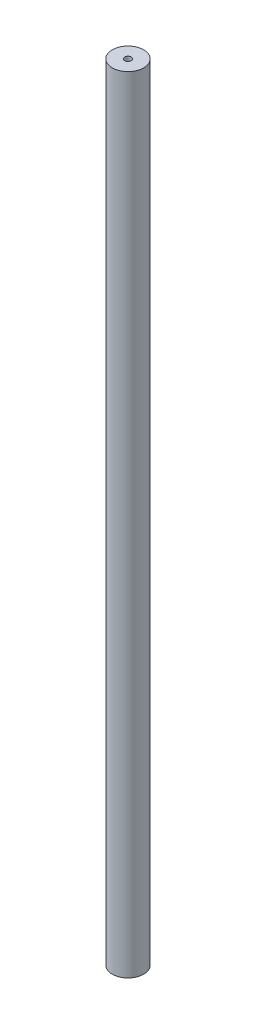
ISO-10303-21;
HEADER;
FILE_DESCRIPTION(('STEP AP214'),'2;1');
FILE_NAME('part.step','',(''),(''),'','','');
FILE_SCHEMA(('AUTOMOTIVE_DESIGN { 1 0 10303 214 1 1 1 1 }'));
ENDSEC;
DATA;
#1=APPLICATION_CONTEXT('core data for automotive mechanical design processes');
#2=APPLICATION_PROTOCOL_DEFINITION('international standard','automotive_design',2000,#1);
#3=PRODUCT_CONTEXT('',#1,'mechanical');
#4=PRODUCT('Part','Part','',(#3));
#5=PRODUCT_RELATED_PRODUCT_CATEGORY('part','',(#4));
#6=PRODUCT_DEFINITION_FORMATION('','',#4);
#7=PRODUCT_DEFINITION_CONTEXT('part definition',#1,'design');
#8=PRODUCT_DEFINITION('design','',#6,#7);
#9=PRODUCT_DEFINITION_SHAPE('','',#8);
#10=(LENGTH_UNIT() NAMED_UNIT(*) SI_UNIT(.MILLI.,.METRE.));
#11=(NAMED_UNIT(*) PLANE_ANGLE_UNIT() SI_UNIT($,.RADIAN.));
#12=(NAMED_UNIT(*) SI_UNIT($,.STERADIAN.) SOLID_ANGLE_UNIT());
#13=UNCERTAINTY_MEASURE_WITH_UNIT(LENGTH_MEASURE(1.E-05),#10,'distance_accuracy_value','');
#14=(GEOMETRIC_REPRESENTATION_CONTEXT(3) GLOBAL_UNCERTAINTY_ASSIGNED_CONTEXT((#13)) GLOBAL_UNIT_ASSIGNED_CONTEXT((#10,
#11,#12)) REPRESENTATION_CONTEXT('',''));
#15=CARTESIAN_POINT('',(0.,0.,0.));
#16=DIRECTION('',(0.,0.,1.));
#17=DIRECTION('',(1.,0.,0.));
#18=AXIS2_PLACEMENT_3D('',#15,#16,#17);
#19=CARTESIAN_POINT('',(0.,250.,0.));
#20=DIRECTION('',(0.,-1.,0.));
#21=DIRECTION('',(0.,0.,-1.));
#22=AXIS2_PLACEMENT_3D('',#19,#20,#21);
#23=CYLINDRICAL_SURFACE('',#22,5.);
#24=CARTESIAN_POINT('',(0.,250.,0.));
#25=DIRECTION('',(0.,1.,0.));
#26=DIRECTION('',(0.,0.,1.));
#27=AXIS2_PLACEMENT_3D('',#24,#25,#26);
#28=CIRCLE('',#27,5.);
#29=CARTESIAN_POINT('',(0.,250.,5.));
#30=VERTEX_POINT('',#29);
#31=EDGE_CURVE('E10',#30,#30,#28,.T.);
#32=ORIENTED_EDGE('',*,*,#31,.F.);
#33=EDGE_LOOP('',(#32));
#34=FACE_BOUND('',#33,.T.);
#35=CARTESIAN_POINT('',(0.,0.,0.));
#36=DIRECTION('',(0.,1.,0.));
#37=DIRECTION('',(0.,0.,1.));
#38=AXIS2_PLACEMENT_3D('',#35,#36,#37);
#39=CIRCLE('',#38,5.);
#40=CARTESIAN_POINT('',(0.,0.,5.));
#41=VERTEX_POINT('',#40);
#42=EDGE_CURVE('E43',#41,#41,#39,.T.);
#43=ORIENTED_EDGE('',*,*,#42,.T.);
#44=EDGE_LOOP('',(#43));
#45=FACE_BOUND('',#44,.T.);
#46=ADVANCED_FACE('F40',(#34,#45),#23,.T.);
#47=CARTESIAN_POINT('',(0.,250.,0.));
#48=DIRECTION('',(0.,1.,0.));
#49=DIRECTION('',(0.,0.,1.));
#50=AXIS2_PLACEMENT_3D('',#47,#48,#49);
#51=PLANE('',#50);
#52=CARTESIAN_POINT('',(0.,250.,0.));
#53=DIRECTION('',(0.,-1.,0.));
#54=DIRECTION('',(0.,0.,-1.));
#55=AXIS2_PLACEMENT_3D('',#52,#53,#54);
#56=CIRCLE('',#55,1.02869999999993);
#57=CARTESIAN_POINT('',(0.,250.,-1.02869999999993));
#58=VERTEX_POINT('',#57);
#59=EDGE_CURVE('E52',#58,#58,#56,.T.);
#60=ORIENTED_EDGE('',*,*,#59,.T.);
#61=EDGE_LOOP('',(#60));
#62=FACE_BOUND('',#61,.T.);
#63=ORIENTED_EDGE('',*,*,#31,.T.);
#64=EDGE_LOOP('',(#63));
#65=FACE_BOUND('',#64,.T.);
#66=ADVANCED_FACE('F72',(#62,#65),#51,.T.);
#67=CARTESIAN_POINT('',(0.,0.,0.));
#68=DIRECTION('',(0.,1.,0.));
#69=DIRECTION('',(0.,0.,1.));
#70=AXIS2_PLACEMENT_3D('',#67,#68,#69);
#71=PLANE('',#70);
#72=CARTESIAN_POINT('',(0.,0.,0.));
#73=DIRECTION('',(0.,-1.,0.));
#74=DIRECTION('',(0.,0.,-1.));
#75=AXIS2_PLACEMENT_3D('',#72,#73,#74);
#76=CIRCLE('',#75,2.1336);
#77=CARTESIAN_POINT('',(0.,0.,-2.1336));
#78=VERTEX_POINT('',#77);
#79=EDGE_CURVE('E61',#78,#78,#76,.T.);
#80=ORIENTED_EDGE('',*,*,#79,.F.);
#81=EDGE_LOOP('',(#80));
#82=FACE_BOUND('',#81,.T.);
#83=ORIENTED_EDGE('',*,*,#42,.F.);
#84=EDGE_LOOP('',(#83));
#85=FACE_BOUND('',#84,.T.);
#86=ADVANCED_FACE('F68',(#82,#85),#71,.F.);
#87=CARTESIAN_POINT('',(0.,0.,0.));
#88=DIRECTION('',(0.,-1.,0.));
#89=DIRECTION('',(0.,0.,-1.));
#90=AXIS2_PLACEMENT_3D('',#87,#88,#89);
#91=CYLINDRICAL_SURFACE('',#90,1.02869999999996);
#92=ORIENTED_EDGE('',*,*,#59,.F.);
#93=EDGE_LOOP('',(#92));
#94=FACE_BOUND('',#93,.T.);
#95=CARTESIAN_POINT('',(0.,1.27104205313849,0.));
#96=DIRECTION('',(0.,-1.,0.));
#97=DIRECTION('',(0.,0.,-1.));
#98=AXIS2_PLACEMENT_3D('',#95,#96,#97);
#99=CIRCLE('',#98,1.02869999999999);
#100=CARTESIAN_POINT('',(0.,1.27104205313849,-1.02869999999999));
#101=VERTEX_POINT('',#100);
#102=EDGE_CURVE('E57',#101,#101,#99,.T.);
#103=ORIENTED_EDGE('',*,*,#102,.T.);
#104=EDGE_LOOP('',(#103));
#105=FACE_BOUND('',#104,.T.);
#106=ADVANCED_FACE('F71',(#94,#105),#91,.F.);
#107=CARTESIAN_POINT('',(0.,0.,0.));
#108=DIRECTION('',(0.,-1.,0.));
#109=DIRECTION('',(0.,0.,-1.));
#110=AXIS2_PLACEMENT_3D('',#107,#108,#109);
#111=CONICAL_SURFACE('',#110,2.1336,0.715584993317679);
#112=ORIENTED_EDGE('',*,*,#102,.F.);
#113=EDGE_LOOP('',(#112));
#114=FACE_BOUND('',#113,.T.);
#115=ORIENTED_EDGE('',*,*,#79,.T.);
#116=EDGE_LOOP('',(#115));
#117=FACE_BOUND('',#116,.T.);
#118=ADVANCED_FACE('F66',(#114,#117),#111,.F.);
#119=CLOSED_SHELL('',(#46,#66,#86,#106,#118));
#120=MANIFOLD_SOLID_BREP('B2',#119);
#121=ADVANCED_BREP_SHAPE_REPRESENTATION('',(#18,#120),#14);
#122=SHAPE_DEFINITION_REPRESENTATION(#9,#121);
ENDSEC;
END-ISO-10303-21;
